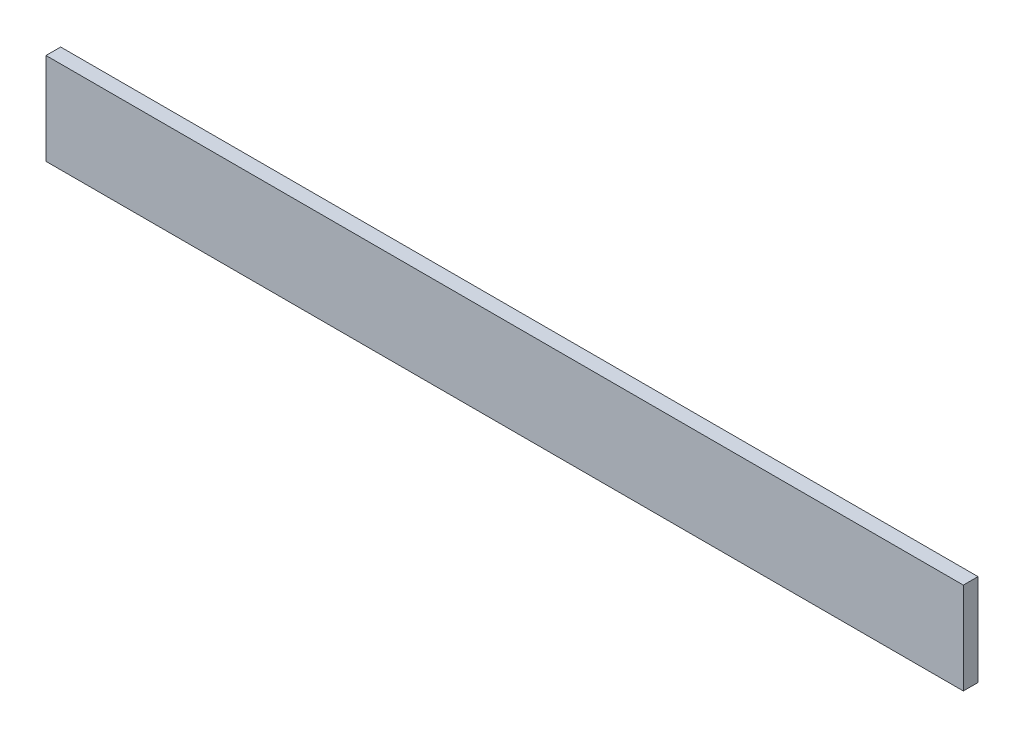
ISO-10303-21;
HEADER;
FILE_DESCRIPTION(('STEP AP214'),'2;1');
FILE_NAME('part.step','',(''),(''),'','','');
FILE_SCHEMA(('AUTOMOTIVE_DESIGN { 1 0 10303 214 1 1 1 1 }'));
ENDSEC;
DATA;
#1=APPLICATION_CONTEXT('core data for automotive mechanical design processes');
#2=APPLICATION_PROTOCOL_DEFINITION('international standard','automotive_design',2000,#1);
#3=PRODUCT_CONTEXT('',#1,'mechanical');
#4=PRODUCT('Part','Part','',(#3));
#5=PRODUCT_RELATED_PRODUCT_CATEGORY('part','',(#4));
#6=PRODUCT_DEFINITION_FORMATION('','',#4);
#7=PRODUCT_DEFINITION_CONTEXT('part definition',#1,'design');
#8=PRODUCT_DEFINITION('design','',#6,#7);
#9=PRODUCT_DEFINITION_SHAPE('','',#8);
#10=(LENGTH_UNIT() NAMED_UNIT(*) SI_UNIT(.MILLI.,.METRE.));
#11=(NAMED_UNIT(*) PLANE_ANGLE_UNIT() SI_UNIT($,.RADIAN.));
#12=(NAMED_UNIT(*) SI_UNIT($,.STERADIAN.) SOLID_ANGLE_UNIT());
#13=UNCERTAINTY_MEASURE_WITH_UNIT(LENGTH_MEASURE(1.E-05),#10,'distance_accuracy_value','');
#14=(GEOMETRIC_REPRESENTATION_CONTEXT(3) GLOBAL_UNCERTAINTY_ASSIGNED_CONTEXT((#13)) GLOBAL_UNIT_ASSIGNED_CONTEXT((#10,
#11,#12)) REPRESENTATION_CONTEXT('',''));
#15=CARTESIAN_POINT('',(0.,0.,0.));
#16=DIRECTION('',(0.,0.,1.));
#17=DIRECTION('',(1.,0.,0.));
#18=AXIS2_PLACEMENT_3D('',#15,#16,#17);
#19=CARTESIAN_POINT('',(-95.25,19.05,3.048));
#20=DIRECTION('',(1.,0.,0.));
#21=DIRECTION('',(0.,0.,-1.));
#22=AXIS2_PLACEMENT_3D('',#19,#20,#21);
#23=PLANE('',#22);
#24=DIRECTION('',(0.,-1.,0.));
#25=VECTOR('',#24,1.);
#26=CARTESIAN_POINT('',(-95.25,19.05,0.));
#27=LINE('',#26,#25);
#28=CARTESIAN_POINT('',(-95.25,19.05,0.));
#29=VERTEX_POINT('',#28);
#30=CARTESIAN_POINT('',(-95.25,0.,0.));
#31=VERTEX_POINT('',#30);
#32=EDGE_CURVE('E97',#29,#31,#27,.T.);
#33=ORIENTED_EDGE('',*,*,#32,.T.);
#34=DIRECTION('',(0.,0.,-1.));
#35=VECTOR('',#34,1.);
#36=CARTESIAN_POINT('',(-95.25,0.,3.048));
#37=LINE('',#36,#35);
#38=CARTESIAN_POINT('',(-95.25,0.,3.048));
#39=VERTEX_POINT('',#38);
#40=EDGE_CURVE('E11',#39,#31,#37,.T.);
#41=ORIENTED_EDGE('',*,*,#40,.F.);
#42=DIRECTION('',(0.,-1.,0.));
#43=VECTOR('',#42,1.);
#44=CARTESIAN_POINT('',(-95.25,19.05,3.048));
#45=LINE('',#44,#43);
#46=CARTESIAN_POINT('',(-95.25,19.05,3.048));
#47=VERTEX_POINT('',#46);
#48=EDGE_CURVE('E85',#47,#39,#45,.T.);
#49=ORIENTED_EDGE('',*,*,#48,.F.);
#50=DIRECTION('',(0.,0.,-1.));
#51=VECTOR('',#50,1.);
#52=CARTESIAN_POINT('',(-95.25,19.05,3.048));
#53=LINE('',#52,#51);
#54=EDGE_CURVE('E93',#47,#29,#53,.T.);
#55=ORIENTED_EDGE('',*,*,#54,.T.);
#56=EDGE_LOOP('',(#33,#41,#49,#55));
#57=FACE_BOUND('',#56,.T.);
#58=ADVANCED_FACE('F34',(#57),#23,.F.);
#59=CARTESIAN_POINT('',(-95.25,0.,3.048));
#60=DIRECTION('',(0.,1.,0.));
#61=DIRECTION('',(-1.,0.,0.));
#62=AXIS2_PLACEMENT_3D('',#59,#60,#61);
#63=PLANE('',#62);
#64=DIRECTION('',(1.,0.,0.));
#65=VECTOR('',#64,1.);
#66=CARTESIAN_POINT('',(-95.25,0.,0.));
#67=LINE('',#66,#65);
#68=CARTESIAN_POINT('',(95.25,0.,0.));
#69=VERTEX_POINT('',#68);
#70=EDGE_CURVE('E89',#31,#69,#67,.T.);
#71=ORIENTED_EDGE('',*,*,#70,.T.);
#72=DIRECTION('',(0.,0.,-1.));
#73=VECTOR('',#72,1.);
#74=CARTESIAN_POINT('',(95.25,0.,3.048));
#75=LINE('',#74,#73);
#76=CARTESIAN_POINT('',(95.25,0.,3.048));
#77=VERTEX_POINT('',#76);
#78=EDGE_CURVE('E42',#77,#69,#75,.T.);
#79=ORIENTED_EDGE('',*,*,#78,.F.);
#80=DIRECTION('',(1.,0.,0.));
#81=VECTOR('',#80,1.);
#82=CARTESIAN_POINT('',(-95.25,0.,3.048));
#83=LINE('',#82,#81);
#84=EDGE_CURVE('E80',#39,#77,#83,.T.);
#85=ORIENTED_EDGE('',*,*,#84,.F.);
#86=ORIENTED_EDGE('',*,*,#40,.T.);
#87=EDGE_LOOP('',(#71,#79,#85,#86));
#88=FACE_BOUND('',#87,.T.);
#89=ADVANCED_FACE('F88',(#88),#63,.F.);
#90=CARTESIAN_POINT('',(95.25,19.05,3.048));
#91=DIRECTION('',(-1.,0.,0.));
#92=DIRECTION('',(0.,0.,1.));
#93=AXIS2_PLACEMENT_3D('',#90,#91,#92);
#94=PLANE('',#93);
#95=DIRECTION('',(0.,1.,0.));
#96=VECTOR('',#95,1.);
#97=CARTESIAN_POINT('',(95.25,19.05,0.));
#98=LINE('',#97,#96);
#99=CARTESIAN_POINT('',(95.25,19.05,0.));
#100=VERTEX_POINT('',#99);
#101=EDGE_CURVE('E67',#69,#100,#98,.T.);
#102=ORIENTED_EDGE('',*,*,#101,.T.);
#103=DIRECTION('',(0.,0.,-1.));
#104=VECTOR('',#103,1.);
#105=CARTESIAN_POINT('',(95.25,19.05,3.048));
#106=LINE('',#105,#104);
#107=CARTESIAN_POINT('',(95.25,19.05,3.048));
#108=VERTEX_POINT('',#107);
#109=EDGE_CURVE('E90',#108,#100,#106,.T.);
#110=ORIENTED_EDGE('',*,*,#109,.F.);
#111=DIRECTION('',(0.,1.,0.));
#112=VECTOR('',#111,1.);
#113=CARTESIAN_POINT('',(95.25,19.05,3.048));
#114=LINE('',#113,#112);
#115=EDGE_CURVE('E83',#77,#108,#114,.T.);
#116=ORIENTED_EDGE('',*,*,#115,.F.);
#117=ORIENTED_EDGE('',*,*,#78,.T.);
#118=EDGE_LOOP('',(#102,#110,#116,#117));
#119=FACE_BOUND('',#118,.T.);
#120=ADVANCED_FACE('F91',(#119),#94,.F.);
#121=CARTESIAN_POINT('',(-95.25,19.05,3.048));
#122=DIRECTION('',(0.,-1.,0.));
#123=DIRECTION('',(1.,0.,0.));
#124=AXIS2_PLACEMENT_3D('',#121,#122,#123);
#125=PLANE('',#124);
#126=DIRECTION('',(-1.,0.,0.));
#127=VECTOR('',#126,1.);
#128=CARTESIAN_POINT('',(-95.25,19.05,0.));
#129=LINE('',#128,#127);
#130=EDGE_CURVE('E73',#100,#29,#129,.T.);
#131=ORIENTED_EDGE('',*,*,#130,.T.);
#132=ORIENTED_EDGE('',*,*,#54,.F.);
#133=DIRECTION('',(-1.,0.,0.));
#134=VECTOR('',#133,1.);
#135=CARTESIAN_POINT('',(-95.25,19.05,3.048));
#136=LINE('',#135,#134);
#137=EDGE_CURVE('E50',#108,#47,#136,.T.);
#138=ORIENTED_EDGE('',*,*,#137,.F.);
#139=ORIENTED_EDGE('',*,*,#109,.T.);
#140=EDGE_LOOP('',(#131,#132,#138,#139));
#141=FACE_BOUND('',#140,.T.);
#142=ADVANCED_FACE('F104',(#141),#125,.F.);
#143=CARTESIAN_POINT('',(0.,0.,3.048));
#144=DIRECTION('',(0.,0.,1.));
#145=DIRECTION('',(1.,0.,0.));
#146=AXIS2_PLACEMENT_3D('',#143,#144,#145);
#147=PLANE('',#146);
#148=ORIENTED_EDGE('',*,*,#48,.T.);
#149=ORIENTED_EDGE('',*,*,#84,.T.);
#150=ORIENTED_EDGE('',*,*,#115,.T.);
#151=ORIENTED_EDGE('',*,*,#137,.T.);
#152=EDGE_LOOP('',(#148,#149,#150,#151));
#153=FACE_BOUND('',#152,.T.);
#154=ADVANCED_FACE('F81',(#153),#147,.T.);
#155=CARTESIAN_POINT('',(0.,0.,0.));
#156=DIRECTION('',(0.,0.,1.));
#157=DIRECTION('',(1.,0.,0.));
#158=AXIS2_PLACEMENT_3D('',#155,#156,#157);
#159=PLANE('',#158);
#160=ORIENTED_EDGE('',*,*,#32,.F.);
#161=ORIENTED_EDGE('',*,*,#130,.F.);
#162=ORIENTED_EDGE('',*,*,#101,.F.);
#163=ORIENTED_EDGE('',*,*,#70,.F.);
#164=EDGE_LOOP('',(#160,#161,#162,#163));
#165=FACE_BOUND('',#164,.T.);
#166=ADVANCED_FACE('F107',(#165),#159,.F.);
#167=CLOSED_SHELL('',(#58,#89,#120,#142,#154,#166));
#168=MANIFOLD_SOLID_BREP('B2',#167);
#169=ADVANCED_BREP_SHAPE_REPRESENTATION('',(#18,#168),#14);
#170=SHAPE_DEFINITION_REPRESENTATION(#9,#169);
ENDSEC;
END-ISO-10303-21;
